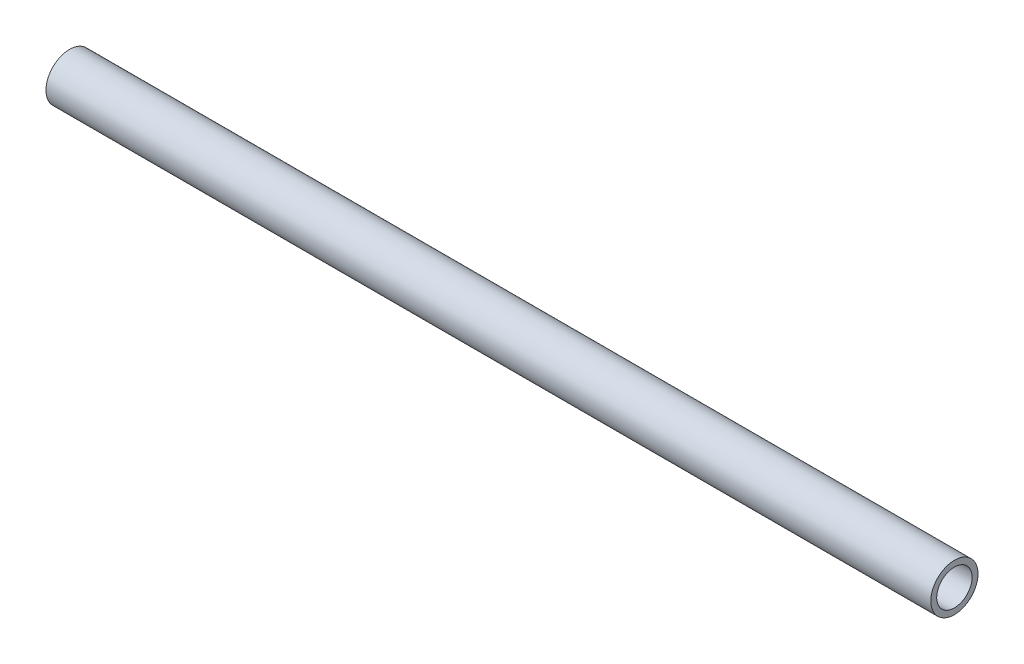
ISO-10303-21;
HEADER;
FILE_DESCRIPTION(('STEP AP214'),'2;1');
FILE_NAME('part.step','',(''),(''),'','','');
FILE_SCHEMA(('AUTOMOTIVE_DESIGN { 1 0 10303 214 1 1 1 1 }'));
ENDSEC;
DATA;
#1=APPLICATION_CONTEXT('core data for automotive mechanical design processes');
#2=APPLICATION_PROTOCOL_DEFINITION('international standard','automotive_design',2000,#1);
#3=PRODUCT_CONTEXT('',#1,'mechanical');
#4=PRODUCT('Part','Part','',(#3));
#5=PRODUCT_RELATED_PRODUCT_CATEGORY('part','',(#4));
#6=PRODUCT_DEFINITION_FORMATION('','',#4);
#7=PRODUCT_DEFINITION_CONTEXT('part definition',#1,'design');
#8=PRODUCT_DEFINITION('design','',#6,#7);
#9=PRODUCT_DEFINITION_SHAPE('','',#8);
#10=(LENGTH_UNIT() NAMED_UNIT(*) SI_UNIT(.MILLI.,.METRE.));
#11=(NAMED_UNIT(*) PLANE_ANGLE_UNIT() SI_UNIT($,.RADIAN.));
#12=(NAMED_UNIT(*) SI_UNIT($,.STERADIAN.) SOLID_ANGLE_UNIT());
#13=UNCERTAINTY_MEASURE_WITH_UNIT(LENGTH_MEASURE(1.E-05),#10,'distance_accuracy_value','');
#14=(GEOMETRIC_REPRESENTATION_CONTEXT(3) GLOBAL_UNCERTAINTY_ASSIGNED_CONTEXT((#13)) GLOBAL_UNIT_ASSIGNED_CONTEXT((#10,
#11,#12)) REPRESENTATION_CONTEXT('',''));
#15=CARTESIAN_POINT('',(0.,0.,0.));
#16=DIRECTION('',(0.,0.,1.));
#17=DIRECTION('',(1.,0.,0.));
#18=AXIS2_PLACEMENT_3D('',#15,#16,#17);
#19=CARTESIAN_POINT('',(150.,0.,0.));
#20=DIRECTION('',(1.,0.,0.));
#21=DIRECTION('',(0.,0.,-1.));
#22=AXIS2_PLACEMENT_3D('',#19,#20,#21);
#23=PLANE('',#22);
#24=CARTESIAN_POINT('',(150.,0.,0.));
#25=DIRECTION('',(1.,0.,0.));
#26=DIRECTION('',(0.,0.,-1.));
#27=AXIS2_PLACEMENT_3D('',#24,#25,#26);
#28=CIRCLE('',#27,8.);
#29=CARTESIAN_POINT('',(150.,0.,-8.));
#30=VERTEX_POINT('',#29);
#31=EDGE_CURVE('E11',#30,#30,#28,.T.);
#32=ORIENTED_EDGE('',*,*,#31,.T.);
#33=EDGE_LOOP('',(#32));
#34=FACE_BOUND('',#33,.T.);
#35=CARTESIAN_POINT('',(150.,0.,0.));
#36=DIRECTION('',(1.,0.,0.));
#37=DIRECTION('',(0.,0.,-1.));
#38=AXIS2_PLACEMENT_3D('',#35,#36,#37);
#39=CIRCLE('',#38,6.);
#40=CARTESIAN_POINT('',(150.,0.,-6.));
#41=VERTEX_POINT('',#40);
#42=EDGE_CURVE('E47',#41,#41,#39,.T.);
#43=ORIENTED_EDGE('',*,*,#42,.F.);
#44=EDGE_LOOP('',(#43));
#45=FACE_BOUND('',#44,.T.);
#46=ADVANCED_FACE('F36',(#34,#45),#23,.T.);
#47=CARTESIAN_POINT('',(-150.,0.,0.));
#48=DIRECTION('',(1.,0.,0.));
#49=DIRECTION('',(0.,0.,-1.));
#50=AXIS2_PLACEMENT_3D('',#47,#48,#49);
#51=PLANE('',#50);
#52=CARTESIAN_POINT('',(-150.,0.,0.));
#53=DIRECTION('',(1.,0.,0.));
#54=DIRECTION('',(0.,0.,-1.));
#55=AXIS2_PLACEMENT_3D('',#52,#53,#54);
#56=CIRCLE('',#55,8.);
#57=CARTESIAN_POINT('',(-150.,0.,-8.));
#58=VERTEX_POINT('',#57);
#59=EDGE_CURVE('E40',#58,#58,#56,.T.);
#60=ORIENTED_EDGE('',*,*,#59,.F.);
#61=EDGE_LOOP('',(#60));
#62=FACE_BOUND('',#61,.T.);
#63=CARTESIAN_POINT('',(-150.,0.,0.));
#64=DIRECTION('',(1.,0.,0.));
#65=DIRECTION('',(0.,0.,-1.));
#66=AXIS2_PLACEMENT_3D('',#63,#64,#65);
#67=CIRCLE('',#66,6.);
#68=CARTESIAN_POINT('',(-150.,0.,-6.));
#69=VERTEX_POINT('',#68);
#70=EDGE_CURVE('E49',#69,#69,#67,.T.);
#71=ORIENTED_EDGE('',*,*,#70,.T.);
#72=EDGE_LOOP('',(#71));
#73=FACE_BOUND('',#72,.T.);
#74=ADVANCED_FACE('F59',(#62,#73),#51,.F.);
#75=CARTESIAN_POINT('',(150.,0.,0.));
#76=DIRECTION('',(-1.,0.,0.));
#77=DIRECTION('',(0.,0.,1.));
#78=AXIS2_PLACEMENT_3D('',#75,#76,#77);
#79=CYLINDRICAL_SURFACE('',#78,8.);
#80=ORIENTED_EDGE('',*,*,#31,.F.);
#81=EDGE_LOOP('',(#80));
#82=FACE_BOUND('',#81,.T.);
#83=ORIENTED_EDGE('',*,*,#59,.T.);
#84=EDGE_LOOP('',(#83));
#85=FACE_BOUND('',#84,.T.);
#86=ADVANCED_FACE('F38',(#82,#85),#79,.T.);
#87=CARTESIAN_POINT('',(150.,0.,0.));
#88=DIRECTION('',(-1.,0.,0.));
#89=DIRECTION('',(0.,0.,1.));
#90=AXIS2_PLACEMENT_3D('',#87,#88,#89);
#91=CYLINDRICAL_SURFACE('',#90,6.);
#92=ORIENTED_EDGE('',*,*,#42,.T.);
#93=EDGE_LOOP('',(#92));
#94=FACE_BOUND('',#93,.T.);
#95=ORIENTED_EDGE('',*,*,#70,.F.);
#96=EDGE_LOOP('',(#95));
#97=FACE_BOUND('',#96,.T.);
#98=ADVANCED_FACE('F55',(#94,#97),#91,.F.);
#99=CLOSED_SHELL('',(#46,#74,#86,#98));
#100=MANIFOLD_SOLID_BREP('B2',#99);
#101=ADVANCED_BREP_SHAPE_REPRESENTATION('',(#18,#100),#14);
#102=SHAPE_DEFINITION_REPRESENTATION(#9,#101);
ENDSEC;
END-ISO-10303-21;
